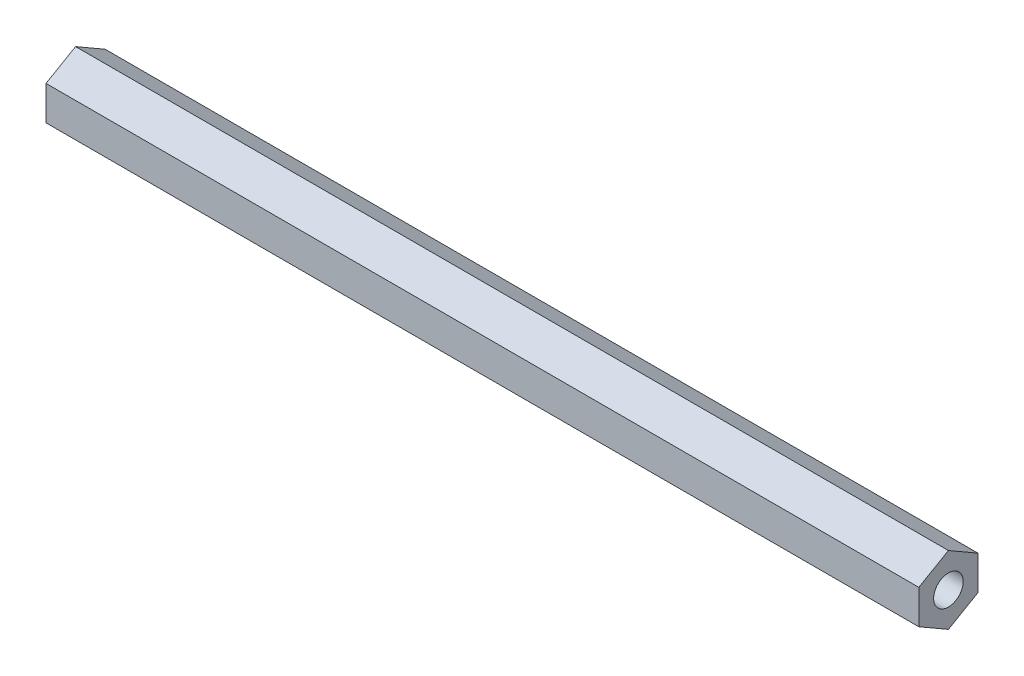
ISO-10303-21;
HEADER;
FILE_DESCRIPTION(('STEP AP214'),'2;1');
FILE_NAME('part.step','',(''),(''),'','','');
FILE_SCHEMA(('AUTOMOTIVE_DESIGN { 1 0 10303 214 1 1 1 1 }'));
ENDSEC;
DATA;
#1=APPLICATION_CONTEXT('core data for automotive mechanical design processes');
#2=APPLICATION_PROTOCOL_DEFINITION('international standard','automotive_design',2000,#1);
#3=PRODUCT_CONTEXT('',#1,'mechanical');
#4=PRODUCT('Part','Part','',(#3));
#5=PRODUCT_RELATED_PRODUCT_CATEGORY('part','',(#4));
#6=PRODUCT_DEFINITION_FORMATION('','',#4);
#7=PRODUCT_DEFINITION_CONTEXT('part definition',#1,'design');
#8=PRODUCT_DEFINITION('design','',#6,#7);
#9=PRODUCT_DEFINITION_SHAPE('','',#8);
#10=(LENGTH_UNIT() NAMED_UNIT(*) SI_UNIT(.MILLI.,.METRE.));
#11=(NAMED_UNIT(*) PLANE_ANGLE_UNIT() SI_UNIT($,.RADIAN.));
#12=(NAMED_UNIT(*) SI_UNIT($,.STERADIAN.) SOLID_ANGLE_UNIT());
#13=UNCERTAINTY_MEASURE_WITH_UNIT(LENGTH_MEASURE(1.E-05),#10,'distance_accuracy_value','');
#14=(GEOMETRIC_REPRESENTATION_CONTEXT(3) GLOBAL_UNCERTAINTY_ASSIGNED_CONTEXT((#13)) GLOBAL_UNIT_ASSIGNED_CONTEXT((#10,
#11,#12)) REPRESENTATION_CONTEXT('',''));
#15=CARTESIAN_POINT('',(0.,0.,0.));
#16=DIRECTION('',(0.,0.,1.));
#17=DIRECTION('',(1.,0.,0.));
#18=AXIS2_PLACEMENT_3D('',#15,#16,#17);
#19=CARTESIAN_POINT('',(187.325,0.,0.));
#20=DIRECTION('',(1.,0.,0.));
#21=DIRECTION('',(0.,0.,-1.));
#22=AXIS2_PLACEMENT_3D('',#19,#20,#21);
#23=PLANE('',#22);
#24=DIRECTION('',(0.,0.499999999999995,0.866025403784442));
#25=VECTOR('',#24,1.);
#26=CARTESIAN_POINT('',(187.325,3.66617420935419,-6.34999999999995));
#27=LINE('',#26,#25);
#28=CARTESIAN_POINT('',(187.325,3.66617420935419,-6.34999999999995));
#29=VERTEX_POINT('',#28);
#30=CARTESIAN_POINT('',(187.325,7.33234841870824,0.));
#31=VERTEX_POINT('',#30);
#32=EDGE_CURVE('E134',#29,#31,#27,.T.);
#33=ORIENTED_EDGE('',*,*,#32,.T.);
#34=DIRECTION('',(0.,-0.500000000000001,0.866025403784438));
#35=VECTOR('',#34,1.);
#36=CARTESIAN_POINT('',(187.325,7.33234841870824,0.));
#37=LINE('',#36,#35);
#38=CARTESIAN_POINT('',(187.325,3.6661742093541,6.35));
#39=VERTEX_POINT('',#38);
#40=EDGE_CURVE('E93',#31,#39,#37,.T.);
#41=ORIENTED_EDGE('',*,*,#40,.T.);
#42=DIRECTION('',(0.,-1.,0.));
#43=VECTOR('',#42,1.);
#44=CARTESIAN_POINT('',(187.325,3.6661742093541,6.35));
#45=LINE('',#44,#43);
#46=CARTESIAN_POINT('',(187.325,-3.66617420935415,6.34999999999997));
#47=VERTEX_POINT('',#46);
#48=EDGE_CURVE('E106',#39,#47,#45,.T.);
#49=ORIENTED_EDGE('',*,*,#48,.T.);
#50=DIRECTION('',(0.,-0.499999999999995,-0.866025403784442));
#51=VECTOR('',#50,1.);
#52=CARTESIAN_POINT('',(187.325,-3.66617420935415,6.34999999999997));
#53=LINE('',#52,#51);
#54=CARTESIAN_POINT('',(187.325,-7.33234841870824,0.));
#55=VERTEX_POINT('',#54);
#56=EDGE_CURVE('E99',#47,#55,#53,.T.);
#57=ORIENTED_EDGE('',*,*,#56,.T.);
#58=DIRECTION('',(0.,0.500000000000007,-0.866025403784435));
#59=VECTOR('',#58,1.);
#60=CARTESIAN_POINT('',(187.325,-7.33234841870824,0.));
#61=LINE('',#60,#59);
#62=CARTESIAN_POINT('',(187.325,-3.66617420935406,-6.35000000000002));
#63=VERTEX_POINT('',#62);
#64=EDGE_CURVE('E101',#55,#63,#61,.T.);
#65=ORIENTED_EDGE('',*,*,#64,.T.);
#66=DIRECTION('',(0.,1.,0.));
#67=VECTOR('',#66,1.);
#68=CARTESIAN_POINT('',(187.325,-3.66617420935406,-6.35000000000002));
#69=LINE('',#68,#67);
#70=EDGE_CURVE('E57',#63,#29,#69,.T.);
#71=ORIENTED_EDGE('',*,*,#70,.T.);
#72=EDGE_LOOP('',(#33,#41,#49,#57,#65,#71));
#73=FACE_BOUND('',#72,.T.);
#74=CARTESIAN_POINT('',(187.325,0.,0.));
#75=DIRECTION('',(1.,0.,0.));
#76=DIRECTION('',(0.,0.,-1.));
#77=AXIS2_PLACEMENT_3D('',#74,#75,#76);
#78=CIRCLE('',#77,3.175);
#79=CARTESIAN_POINT('',(187.325,0.,-3.175));
#80=VERTEX_POINT('',#79);
#81=EDGE_CURVE('E126',#80,#80,#78,.T.);
#82=ORIENTED_EDGE('',*,*,#81,.F.);
#83=EDGE_LOOP('',(#82));
#84=FACE_BOUND('',#83,.T.);
#85=ADVANCED_FACE('F39',(#73,#84),#23,.T.);
#86=CARTESIAN_POINT('',(0.,0.,0.));
#87=DIRECTION('',(1.,0.,0.));
#88=DIRECTION('',(0.,0.,-1.));
#89=AXIS2_PLACEMENT_3D('',#86,#87,#88);
#90=PLANE('',#89);
#91=DIRECTION('',(0.,0.499999999999995,0.866025403784442));
#92=VECTOR('',#91,1.);
#93=CARTESIAN_POINT('',(0.,3.66617420935419,-6.34999999999995));
#94=LINE('',#93,#92);
#95=CARTESIAN_POINT('',(0.,3.66617420935419,-6.34999999999995));
#96=VERTEX_POINT('',#95);
#97=CARTESIAN_POINT('',(0.,7.33234841870824,0.));
#98=VERTEX_POINT('',#97);
#99=EDGE_CURVE('E125',#96,#98,#94,.T.);
#100=ORIENTED_EDGE('',*,*,#99,.F.);
#101=DIRECTION('',(0.,1.,0.));
#102=VECTOR('',#101,1.);
#103=CARTESIAN_POINT('',(0.,-3.66617420935406,-6.35000000000002));
#104=LINE('',#103,#102);
#105=CARTESIAN_POINT('',(0.,-3.66617420935406,-6.35000000000002));
#106=VERTEX_POINT('',#105);
#107=EDGE_CURVE('E82',#106,#96,#104,.T.);
#108=ORIENTED_EDGE('',*,*,#107,.F.);
#109=DIRECTION('',(0.,0.500000000000007,-0.866025403784435));
#110=VECTOR('',#109,1.);
#111=CARTESIAN_POINT('',(0.,-7.33234841870824,0.));
#112=LINE('',#111,#110);
#113=CARTESIAN_POINT('',(0.,-7.33234841870824,0.));
#114=VERTEX_POINT('',#113);
#115=EDGE_CURVE('E80',#114,#106,#112,.T.);
#116=ORIENTED_EDGE('',*,*,#115,.F.);
#117=DIRECTION('',(0.,-0.499999999999995,-0.866025403784442));
#118=VECTOR('',#117,1.);
#119=CARTESIAN_POINT('',(0.,-3.66617420935415,6.34999999999997));
#120=LINE('',#119,#118);
#121=CARTESIAN_POINT('',(0.,-3.66617420935415,6.34999999999997));
#122=VERTEX_POINT('',#121);
#123=EDGE_CURVE('E114',#122,#114,#120,.T.);
#124=ORIENTED_EDGE('',*,*,#123,.F.);
#125=DIRECTION('',(0.,-1.,0.));
#126=VECTOR('',#125,1.);
#127=CARTESIAN_POINT('',(0.,3.6661742093541,6.35));
#128=LINE('',#127,#126);
#129=CARTESIAN_POINT('',(0.,3.6661742093541,6.35));
#130=VERTEX_POINT('',#129);
#131=EDGE_CURVE('E127',#130,#122,#128,.T.);
#132=ORIENTED_EDGE('',*,*,#131,.F.);
#133=DIRECTION('',(0.,-0.500000000000001,0.866025403784438));
#134=VECTOR('',#133,1.);
#135=CARTESIAN_POINT('',(0.,7.33234841870824,0.));
#136=LINE('',#135,#134);
#137=EDGE_CURVE('E130',#98,#130,#136,.T.);
#138=ORIENTED_EDGE('',*,*,#137,.F.);
#139=EDGE_LOOP('',(#100,#108,#116,#124,#132,#138));
#140=FACE_BOUND('',#139,.T.);
#141=CARTESIAN_POINT('',(0.,0.,0.));
#142=DIRECTION('',(1.,0.,0.));
#143=DIRECTION('',(0.,0.,-1.));
#144=AXIS2_PLACEMENT_3D('',#141,#142,#143);
#145=CIRCLE('',#144,3.175);
#146=CARTESIAN_POINT('',(0.,0.,-3.175));
#147=VERTEX_POINT('',#146);
#148=EDGE_CURVE('E228',#147,#147,#145,.T.);
#149=ORIENTED_EDGE('',*,*,#148,.T.);
#150=EDGE_LOOP('',(#149));
#151=FACE_BOUND('',#150,.T.);
#152=ADVANCED_FACE('F143',(#140,#151),#90,.F.);
#153=CARTESIAN_POINT('',(187.325,3.66617420935419,-6.34999999999995));
#154=DIRECTION('',(0.,-0.866025403784441,0.499999999999995));
#155=DIRECTION('',(0.,-0.499999999999995,-0.866025403784442));
#156=AXIS2_PLACEMENT_3D('',#153,#154,#155);
#157=PLANE('',#156);
#158=ORIENTED_EDGE('',*,*,#99,.T.);
#159=DIRECTION('',(-1.,0.,0.));
#160=VECTOR('',#159,1.);
#161=CARTESIAN_POINT('',(187.325,7.33234841870824,0.));
#162=LINE('',#161,#160);
#163=EDGE_CURVE('E11',#31,#98,#162,.T.);
#164=ORIENTED_EDGE('',*,*,#163,.F.);
#165=ORIENTED_EDGE('',*,*,#32,.F.);
#166=DIRECTION('',(-1.,0.,0.));
#167=VECTOR('',#166,1.);
#168=CARTESIAN_POINT('',(187.325,3.66617420935419,-6.34999999999995));
#169=LINE('',#168,#167);
#170=EDGE_CURVE('E120',#29,#96,#169,.T.);
#171=ORIENTED_EDGE('',*,*,#170,.T.);
#172=EDGE_LOOP('',(#158,#164,#165,#171));
#173=FACE_BOUND('',#172,.T.);
#174=ADVANCED_FACE('F41',(#173),#157,.F.);
#175=CARTESIAN_POINT('',(187.325,7.33234841870824,0.));
#176=DIRECTION('',(0.,-0.866025403784438,-0.500000000000001));
#177=DIRECTION('',(0.,0.500000000000001,-0.866025403784438));
#178=AXIS2_PLACEMENT_3D('',#175,#176,#177);
#179=PLANE('',#178);
#180=ORIENTED_EDGE('',*,*,#137,.T.);
#181=DIRECTION('',(-1.,0.,0.));
#182=VECTOR('',#181,1.);
#183=CARTESIAN_POINT('',(187.325,3.6661742093541,6.35));
#184=LINE('',#183,#182);
#185=EDGE_CURVE('E48',#39,#130,#184,.T.);
#186=ORIENTED_EDGE('',*,*,#185,.F.);
#187=ORIENTED_EDGE('',*,*,#40,.F.);
#188=ORIENTED_EDGE('',*,*,#163,.T.);
#189=EDGE_LOOP('',(#180,#186,#187,#188));
#190=FACE_BOUND('',#189,.T.);
#191=ADVANCED_FACE('F170',(#190),#179,.F.);
#192=CARTESIAN_POINT('',(187.325,3.6661742093541,6.35));
#193=DIRECTION('',(0.,0.,-1.));
#194=DIRECTION('',(0.,1.,0.));
#195=AXIS2_PLACEMENT_3D('',#192,#193,#194);
#196=PLANE('',#195);
#197=ORIENTED_EDGE('',*,*,#131,.T.);
#198=DIRECTION('',(-1.,0.,0.));
#199=VECTOR('',#198,1.);
#200=CARTESIAN_POINT('',(187.325,-3.66617420935415,6.34999999999997));
#201=LINE('',#200,#199);
#202=EDGE_CURVE('E113',#47,#122,#201,.T.);
#203=ORIENTED_EDGE('',*,*,#202,.F.);
#204=ORIENTED_EDGE('',*,*,#48,.F.);
#205=ORIENTED_EDGE('',*,*,#185,.T.);
#206=EDGE_LOOP('',(#197,#203,#204,#205));
#207=FACE_BOUND('',#206,.T.);
#208=ADVANCED_FACE('F141',(#207),#196,.F.);
#209=CARTESIAN_POINT('',(187.325,-3.66617420935415,6.34999999999997));
#210=DIRECTION('',(0.,0.866025403784442,-0.499999999999995));
#211=DIRECTION('',(0.,0.499999999999995,0.866025403784442));
#212=AXIS2_PLACEMENT_3D('',#209,#210,#211);
#213=PLANE('',#212);
#214=ORIENTED_EDGE('',*,*,#123,.T.);
#215=DIRECTION('',(-1.,0.,0.));
#216=VECTOR('',#215,1.);
#217=CARTESIAN_POINT('',(187.325,-7.33234841870824,0.));
#218=LINE('',#217,#216);
#219=EDGE_CURVE('E112',#55,#114,#218,.T.);
#220=ORIENTED_EDGE('',*,*,#219,.F.);
#221=ORIENTED_EDGE('',*,*,#56,.F.);
#222=ORIENTED_EDGE('',*,*,#202,.T.);
#223=EDGE_LOOP('',(#214,#220,#221,#222));
#224=FACE_BOUND('',#223,.T.);
#225=ADVANCED_FACE('F115',(#224),#213,.F.);
#226=CARTESIAN_POINT('',(187.325,-7.33234841870824,0.));
#227=DIRECTION('',(0.,0.866025403784435,0.500000000000007));
#228=DIRECTION('',(0.,-0.500000000000007,0.866025403784435));
#229=AXIS2_PLACEMENT_3D('',#226,#227,#228);
#230=PLANE('',#229);
#231=ORIENTED_EDGE('',*,*,#115,.T.);
#232=DIRECTION('',(-1.,0.,0.));
#233=VECTOR('',#232,1.);
#234=CARTESIAN_POINT('',(187.325,-3.66617420935406,-6.35000000000002));
#235=LINE('',#234,#233);
#236=EDGE_CURVE('E116',#63,#106,#235,.T.);
#237=ORIENTED_EDGE('',*,*,#236,.F.);
#238=ORIENTED_EDGE('',*,*,#64,.F.);
#239=ORIENTED_EDGE('',*,*,#219,.T.);
#240=EDGE_LOOP('',(#231,#237,#238,#239));
#241=FACE_BOUND('',#240,.T.);
#242=ADVANCED_FACE('F119',(#241),#230,.F.);
#243=CARTESIAN_POINT('',(187.325,-3.66617420935406,-6.35000000000002));
#244=DIRECTION('',(0.,0.,1.));
#245=DIRECTION('',(0.,-1.,0.));
#246=AXIS2_PLACEMENT_3D('',#243,#244,#245);
#247=PLANE('',#246);
#248=ORIENTED_EDGE('',*,*,#107,.T.);
#249=ORIENTED_EDGE('',*,*,#170,.F.);
#250=ORIENTED_EDGE('',*,*,#70,.F.);
#251=ORIENTED_EDGE('',*,*,#236,.T.);
#252=EDGE_LOOP('',(#248,#249,#250,#251));
#253=FACE_BOUND('',#252,.T.);
#254=ADVANCED_FACE('F146',(#253),#247,.F.);
#255=CARTESIAN_POINT('',(187.325,0.,0.));
#256=DIRECTION('',(-1.,0.,0.));
#257=DIRECTION('',(0.,0.,1.));
#258=AXIS2_PLACEMENT_3D('',#255,#256,#257);
#259=CYLINDRICAL_SURFACE('',#258,3.175);
#260=ORIENTED_EDGE('',*,*,#81,.T.);
#261=EDGE_LOOP('',(#260));
#262=FACE_BOUND('',#261,.T.);
#263=ORIENTED_EDGE('',*,*,#148,.F.);
#264=EDGE_LOOP('',(#263));
#265=FACE_BOUND('',#264,.T.);
#266=ADVANCED_FACE('F151',(#262,#265),#259,.F.);
#267=CLOSED_SHELL('',(#85,#152,#174,#191,#208,#225,#242,#254,#266));
#268=MANIFOLD_SOLID_BREP('B2',#267);
#269=ADVANCED_BREP_SHAPE_REPRESENTATION('',(#18,#268),#14);
#270=SHAPE_DEFINITION_REPRESENTATION(#9,#269);
ENDSEC;
END-ISO-10303-21;
